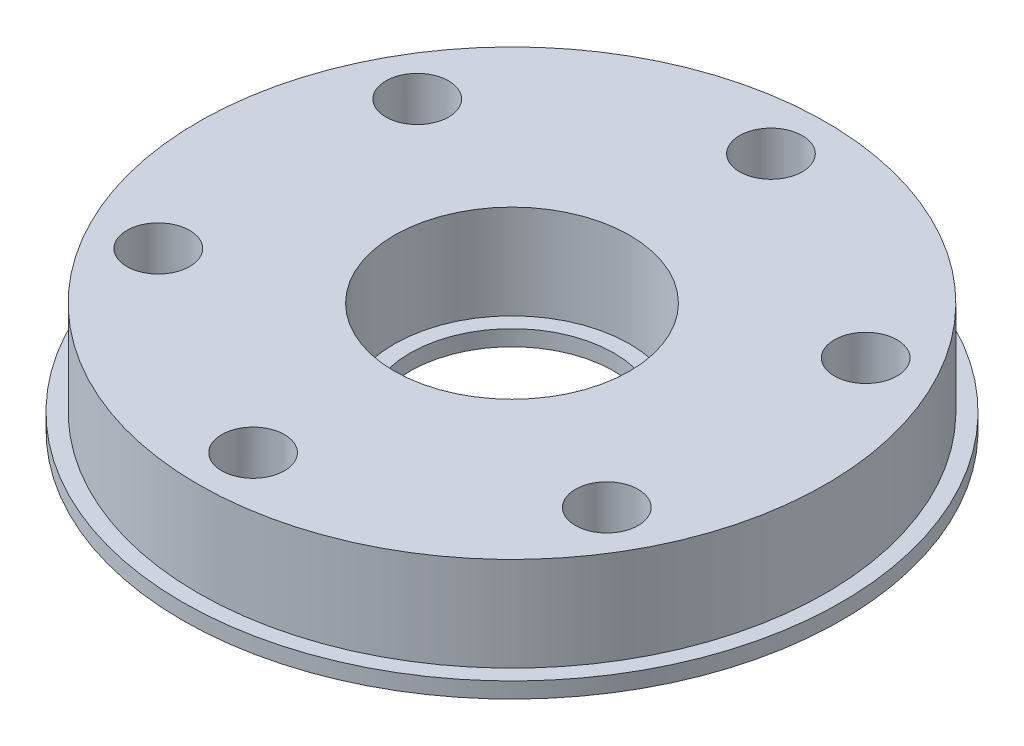
ISO-10303-21;
HEADER;
FILE_DESCRIPTION(('STEP AP214'),'2;1');
FILE_NAME('part.step','',(''),(''),'','','');
FILE_SCHEMA(('AUTOMOTIVE_DESIGN { 1 0 10303 214 1 1 1 1 }'));
ENDSEC;
DATA;
#1=APPLICATION_CONTEXT('core data for automotive mechanical design processes');
#2=APPLICATION_PROTOCOL_DEFINITION('international standard','automotive_design',2000,#1);
#3=PRODUCT_CONTEXT('',#1,'mechanical');
#4=PRODUCT('Part','Part','',(#3));
#5=PRODUCT_RELATED_PRODUCT_CATEGORY('part','',(#4));
#6=PRODUCT_DEFINITION_FORMATION('','',#4);
#7=PRODUCT_DEFINITION_CONTEXT('part definition',#1,'design');
#8=PRODUCT_DEFINITION('design','',#6,#7);
#9=PRODUCT_DEFINITION_SHAPE('','',#8);
#10=(LENGTH_UNIT() NAMED_UNIT(*) SI_UNIT(.MILLI.,.METRE.));
#11=(NAMED_UNIT(*) PLANE_ANGLE_UNIT() SI_UNIT($,.RADIAN.));
#12=(NAMED_UNIT(*) SI_UNIT($,.STERADIAN.) SOLID_ANGLE_UNIT());
#13=UNCERTAINTY_MEASURE_WITH_UNIT(LENGTH_MEASURE(1.E-05),#10,'distance_accuracy_value','');
#14=(GEOMETRIC_REPRESENTATION_CONTEXT(3) GLOBAL_UNCERTAINTY_ASSIGNED_CONTEXT((#13)) GLOBAL_UNIT_ASSIGNED_CONTEXT((#10,
#11,#12)) REPRESENTATION_CONTEXT('',''));
#15=CARTESIAN_POINT('',(0.,0.,0.));
#16=DIRECTION('',(0.,0.,1.));
#17=DIRECTION('',(1.,0.,0.));
#18=AXIS2_PLACEMENT_3D('',#15,#16,#17);
#19=CARTESIAN_POINT('',(0.,6.,0.));
#20=DIRECTION('',(0.,1.,0.));
#21=DIRECTION('',(0.,0.,1.));
#22=AXIS2_PLACEMENT_3D('',#19,#20,#21);
#23=PLANE('',#22);
#24=CARTESIAN_POINT('',(14.2894191624431,6.,-8.25000000000017));
#25=DIRECTION('',(0.,1.,0.));
#26=DIRECTION('',(-0.866025403784433,0.,0.50000000000001));
#27=AXIS2_PLACEMENT_3D('',#24,#25,#26);
#28=CIRCLE('',#27,2.);
#29=CARTESIAN_POINT('',(12.5573683548743,6.,-7.25000000000015));
#30=VERTEX_POINT('',#29);
#31=EDGE_CURVE('E63',#30,#30,#28,.T.);
#32=ORIENTED_EDGE('',*,*,#31,.F.);
#33=EDGE_LOOP('',(#32));
#34=FACE_BOUND('',#33,.T.);
#35=CARTESIAN_POINT('',(14.2894191624433,6.,8.24999999999987));
#36=DIRECTION('',(0.,1.,0.));
#37=DIRECTION('',(-0.866025403784443,0.,-0.499999999999992));
#38=AXIS2_PLACEMENT_3D('',#35,#36,#37);
#39=CIRCLE('',#38,2.);
#40=CARTESIAN_POINT('',(12.5573683548744,6.,7.24999999999988));
#41=VERTEX_POINT('',#40);
#42=EDGE_CURVE('E66',#41,#41,#39,.T.);
#43=ORIENTED_EDGE('',*,*,#42,.F.);
#44=EDGE_LOOP('',(#43));
#45=FACE_BOUND('',#44,.T.);
#46=CARTESIAN_POINT('',(0.,6.,16.5));
#47=DIRECTION('',(0.,1.,0.));
#48=DIRECTION('',(0.,0.,-1.));
#49=AXIS2_PLACEMENT_3D('',#46,#47,#48);
#50=CIRCLE('',#49,2.);
#51=CARTESIAN_POINT('',(0.,6.,14.5));
#52=VERTEX_POINT('',#51);
#53=EDGE_CURVE('E69',#52,#52,#50,.T.);
#54=ORIENTED_EDGE('',*,*,#53,.F.);
#55=EDGE_LOOP('',(#54));
#56=FACE_BOUND('',#55,.T.);
#57=CARTESIAN_POINT('',(-14.2894191624432,6.,8.25000000000007));
#58=DIRECTION('',(0.,1.,0.));
#59=DIRECTION('',(0.866025403784436,0.,-0.500000000000004));
#60=AXIS2_PLACEMENT_3D('',#57,#58,#59);
#61=CIRCLE('',#60,2.);
#62=CARTESIAN_POINT('',(-12.5573683548743,6.,7.25000000000006));
#63=VERTEX_POINT('',#62);
#64=EDGE_CURVE('E62',#63,#63,#61,.T.);
#65=ORIENTED_EDGE('',*,*,#64,.F.);
#66=EDGE_LOOP('',(#65));
#67=FACE_BOUND('',#66,.T.);
#68=CARTESIAN_POINT('',(-14.2894191624433,6.,-8.24999999999997));
#69=DIRECTION('',(0.,1.,0.));
#70=DIRECTION('',(0.86602540378444,0.,0.499999999999998));
#71=AXIS2_PLACEMENT_3D('',#68,#69,#70);
#72=CIRCLE('',#71,2.);
#73=CARTESIAN_POINT('',(-12.5573683548744,6.,-7.24999999999997));
#74=VERTEX_POINT('',#73);
#75=EDGE_CURVE('E59',#74,#74,#72,.T.);
#76=ORIENTED_EDGE('',*,*,#75,.F.);
#77=EDGE_LOOP('',(#76));
#78=FACE_BOUND('',#77,.T.);
#79=CARTESIAN_POINT('',(0.,6.,-16.5));
#80=DIRECTION('',(0.,1.,0.));
#81=DIRECTION('',(0.,0.,1.));
#82=AXIS2_PLACEMENT_3D('',#79,#80,#81);
#83=CIRCLE('',#82,2.);
#84=CARTESIAN_POINT('',(0.,6.,-14.5));
#85=VERTEX_POINT('',#84);
#86=EDGE_CURVE('E55',#85,#85,#83,.T.);
#87=ORIENTED_EDGE('',*,*,#86,.F.);
#88=EDGE_LOOP('',(#87));
#89=FACE_BOUND('',#88,.T.);
#90=CARTESIAN_POINT('',(0.,6.,0.));
#91=DIRECTION('',(0.,1.,0.));
#92=DIRECTION('',(0.,0.,1.));
#93=AXIS2_PLACEMENT_3D('',#90,#91,#92);
#94=CIRCLE('',#93,20.);
#95=CARTESIAN_POINT('',(0.,6.,20.));
#96=VERTEX_POINT('',#95);
#97=EDGE_CURVE('E10',#96,#96,#94,.T.);
#98=ORIENTED_EDGE('',*,*,#97,.T.);
#99=EDGE_LOOP('',(#98));
#100=FACE_BOUND('',#99,.T.);
#101=CARTESIAN_POINT('',(0.,6.,0.));
#102=DIRECTION('',(0.,1.,0.));
#103=DIRECTION('',(0.,0.,1.));
#104=AXIS2_PLACEMENT_3D('',#101,#102,#103);
#105=CIRCLE('',#104,7.5);
#106=CARTESIAN_POINT('',(0.,6.,7.5));
#107=VERTEX_POINT('',#106);
#108=EDGE_CURVE('E47',#107,#107,#105,.T.);
#109=ORIENTED_EDGE('',*,*,#108,.F.);
#110=EDGE_LOOP('',(#109));
#111=FACE_BOUND('',#110,.T.);
#112=ADVANCED_FACE('F39',(#34,#45,#56,#67,#78,#89,#100,#111),#23,.T.);
#113=CARTESIAN_POINT('',(0.,6.,0.));
#114=DIRECTION('',(0.,-1.,0.));
#115=DIRECTION('',(0.,0.,-1.));
#116=AXIS2_PLACEMENT_3D('',#113,#114,#115);
#117=CYLINDRICAL_SURFACE('',#116,20.);
#118=ORIENTED_EDGE('',*,*,#97,.F.);
#119=EDGE_LOOP('',(#118));
#120=FACE_BOUND('',#119,.T.);
#121=CARTESIAN_POINT('',(0.,0.,0.));
#122=DIRECTION('',(0.,1.,0.));
#123=DIRECTION('',(0.,0.,1.));
#124=AXIS2_PLACEMENT_3D('',#121,#122,#123);
#125=CIRCLE('',#124,20.);
#126=CARTESIAN_POINT('',(0.,0.,20.));
#127=VERTEX_POINT('',#126);
#128=EDGE_CURVE('E43',#127,#127,#125,.T.);
#129=ORIENTED_EDGE('',*,*,#128,.T.);
#130=EDGE_LOOP('',(#129));
#131=FACE_BOUND('',#130,.T.);
#132=ADVANCED_FACE('F41',(#120,#131),#117,.T.);
#133=CARTESIAN_POINT('',(0.,6.,0.));
#134=DIRECTION('',(0.,-1.,0.));
#135=DIRECTION('',(0.,0.,-1.));
#136=AXIS2_PLACEMENT_3D('',#133,#134,#135);
#137=CYLINDRICAL_SURFACE('',#136,7.5);
#138=ORIENTED_EDGE('',*,*,#108,.T.);
#139=EDGE_LOOP('',(#138));
#140=FACE_BOUND('',#139,.T.);
#141=CARTESIAN_POINT('',(0.,0.,0.));
#142=DIRECTION('',(0.,1.,0.));
#143=DIRECTION('',(0.,0.,1.));
#144=AXIS2_PLACEMENT_3D('',#141,#142,#143);
#145=CIRCLE('',#144,7.5);
#146=CARTESIAN_POINT('',(0.,0.,7.5));
#147=VERTEX_POINT('',#146);
#148=EDGE_CURVE('E51',#147,#147,#145,.T.);
#149=ORIENTED_EDGE('',*,*,#148,.F.);
#150=EDGE_LOOP('',(#149));
#151=FACE_BOUND('',#150,.T.);
#152=ADVANCED_FACE('F121',(#140,#151),#137,.F.);
#153=CARTESIAN_POINT('',(0.,0.,-16.5));
#154=DIRECTION('',(0.,1.,0.));
#155=DIRECTION('',(0.,0.,1.));
#156=AXIS2_PLACEMENT_3D('',#153,#154,#155);
#157=CYLINDRICAL_SURFACE('',#156,2.);
#158=ORIENTED_EDGE('',*,*,#86,.T.);
#159=EDGE_LOOP('',(#158));
#160=FACE_BOUND('',#159,.T.);
#161=CARTESIAN_POINT('',(0.,-1.,-16.5));
#162=DIRECTION('',(0.,1.,0.));
#163=DIRECTION('',(0.,0.,1.));
#164=AXIS2_PLACEMENT_3D('',#161,#162,#163);
#165=CIRCLE('',#164,2.);
#166=CARTESIAN_POINT('',(0.,-1.,-14.5));
#167=VERTEX_POINT('',#166);
#168=EDGE_CURVE('E98',#167,#167,#165,.T.);
#169=ORIENTED_EDGE('',*,*,#168,.F.);
#170=EDGE_LOOP('',(#169));
#171=FACE_BOUND('',#170,.T.);
#172=ADVANCED_FACE('F111',(#160,#171),#157,.F.);
#173=CARTESIAN_POINT('',(-14.2894191624433,0.,-8.24999999999997));
#174=DIRECTION('',(0.,1.,0.));
#175=DIRECTION('',(0.,0.,1.));
#176=AXIS2_PLACEMENT_3D('',#173,#174,#175);
#177=CYLINDRICAL_SURFACE('',#176,2.);
#178=ORIENTED_EDGE('',*,*,#75,.T.);
#179=EDGE_LOOP('',(#178));
#180=FACE_BOUND('',#179,.T.);
#181=CARTESIAN_POINT('',(-14.2894191624433,-1.,-8.24999999999997));
#182=DIRECTION('',(0.,1.,0.));
#183=DIRECTION('',(0.,0.,1.));
#184=AXIS2_PLACEMENT_3D('',#181,#182,#183);
#185=CIRCLE('',#184,2.);
#186=CARTESIAN_POINT('',(-14.2894191624433,-1.,-6.24999999999997));
#187=VERTEX_POINT('',#186);
#188=EDGE_CURVE('E101',#187,#187,#185,.T.);
#189=ORIENTED_EDGE('',*,*,#188,.F.);
#190=EDGE_LOOP('',(#189));
#191=FACE_BOUND('',#190,.T.);
#192=ADVANCED_FACE('F108',(#180,#191),#177,.F.);
#193=CARTESIAN_POINT('',(-14.2894191624432,0.,8.25000000000007));
#194=DIRECTION('',(0.,1.,0.));
#195=DIRECTION('',(0.,0.,1.));
#196=AXIS2_PLACEMENT_3D('',#193,#194,#195);
#197=CYLINDRICAL_SURFACE('',#196,2.);
#198=ORIENTED_EDGE('',*,*,#64,.T.);
#199=EDGE_LOOP('',(#198));
#200=FACE_BOUND('',#199,.T.);
#201=CARTESIAN_POINT('',(-14.2894191624432,-1.,8.25000000000007));
#202=DIRECTION('',(0.,1.,0.));
#203=DIRECTION('',(0.,0.,1.));
#204=AXIS2_PLACEMENT_3D('',#201,#202,#203);
#205=CIRCLE('',#204,2.);
#206=CARTESIAN_POINT('',(-14.2894191624432,-1.,10.2500000000001));
#207=VERTEX_POINT('',#206);
#208=EDGE_CURVE('E78',#207,#207,#205,.T.);
#209=ORIENTED_EDGE('',*,*,#208,.F.);
#210=EDGE_LOOP('',(#209));
#211=FACE_BOUND('',#210,.T.);
#212=ADVANCED_FACE('F110',(#200,#211),#197,.F.);
#213=CARTESIAN_POINT('',(0.,0.,16.5));
#214=DIRECTION('',(0.,1.,0.));
#215=DIRECTION('',(0.,0.,1.));
#216=AXIS2_PLACEMENT_3D('',#213,#214,#215);
#217=CYLINDRICAL_SURFACE('',#216,2.);
#218=ORIENTED_EDGE('',*,*,#53,.T.);
#219=EDGE_LOOP('',(#218));
#220=FACE_BOUND('',#219,.T.);
#221=CARTESIAN_POINT('',(0.,-1.,16.5));
#222=DIRECTION('',(0.,1.,0.));
#223=DIRECTION('',(0.,0.,1.));
#224=AXIS2_PLACEMENT_3D('',#221,#222,#223);
#225=CIRCLE('',#224,2.);
#226=CARTESIAN_POINT('',(0.,-1.,18.5));
#227=VERTEX_POINT('',#226);
#228=EDGE_CURVE('E87',#227,#227,#225,.T.);
#229=ORIENTED_EDGE('',*,*,#228,.F.);
#230=EDGE_LOOP('',(#229));
#231=FACE_BOUND('',#230,.T.);
#232=ADVANCED_FACE('F118',(#220,#231),#217,.F.);
#233=CARTESIAN_POINT('',(14.2894191624433,0.,8.24999999999987));
#234=DIRECTION('',(0.,1.,0.));
#235=DIRECTION('',(0.,0.,1.));
#236=AXIS2_PLACEMENT_3D('',#233,#234,#235);
#237=CYLINDRICAL_SURFACE('',#236,2.);
#238=ORIENTED_EDGE('',*,*,#42,.T.);
#239=EDGE_LOOP('',(#238));
#240=FACE_BOUND('',#239,.T.);
#241=CARTESIAN_POINT('',(14.2894191624433,-1.,8.24999999999987));
#242=DIRECTION('',(0.,1.,0.));
#243=DIRECTION('',(0.,0.,1.));
#244=AXIS2_PLACEMENT_3D('',#241,#242,#243);
#245=CIRCLE('',#244,2.);
#246=CARTESIAN_POINT('',(14.2894191624433,-1.,10.2499999999999));
#247=VERTEX_POINT('',#246);
#248=EDGE_CURVE('E92',#247,#247,#245,.T.);
#249=ORIENTED_EDGE('',*,*,#248,.F.);
#250=EDGE_LOOP('',(#249));
#251=FACE_BOUND('',#250,.T.);
#252=ADVANCED_FACE('F155',(#240,#251),#237,.F.);
#253=CARTESIAN_POINT('',(14.2894191624431,0.,-8.25000000000017));
#254=DIRECTION('',(0.,1.,0.));
#255=DIRECTION('',(0.,0.,1.));
#256=AXIS2_PLACEMENT_3D('',#253,#254,#255);
#257=CYLINDRICAL_SURFACE('',#256,2.);
#258=ORIENTED_EDGE('',*,*,#31,.T.);
#259=EDGE_LOOP('',(#258));
#260=FACE_BOUND('',#259,.T.);
#261=CARTESIAN_POINT('',(14.2894191624431,-1.,-8.25000000000017));
#262=DIRECTION('',(0.,1.,0.));
#263=DIRECTION('',(0.,0.,1.));
#264=AXIS2_PLACEMENT_3D('',#261,#262,#263);
#265=CIRCLE('',#264,2.);
#266=CARTESIAN_POINT('',(14.2894191624431,-1.,-6.25000000000017));
#267=VERTEX_POINT('',#266);
#268=EDGE_CURVE('E95',#267,#267,#265,.T.);
#269=ORIENTED_EDGE('',*,*,#268,.F.);
#270=EDGE_LOOP('',(#269));
#271=FACE_BOUND('',#270,.T.);
#272=ADVANCED_FACE('F145',(#260,#271),#257,.F.);
#273=CARTESIAN_POINT('',(0.,0.,0.));
#274=DIRECTION('',(0.,1.,0.));
#275=DIRECTION('',(0.,0.,1.));
#276=AXIS2_PLACEMENT_3D('',#273,#274,#275);
#277=PLANE('',#276);
#278=CARTESIAN_POINT('',(0.,0.,0.));
#279=DIRECTION('',(0.,1.,0.));
#280=DIRECTION('',(0.,0.,1.));
#281=AXIS2_PLACEMENT_3D('',#278,#279,#280);
#282=CIRCLE('',#281,6.5);
#283=CARTESIAN_POINT('',(0.,0.,6.5));
#284=VERTEX_POINT('',#283);
#285=EDGE_CURVE('E84',#284,#284,#282,.T.);
#286=ORIENTED_EDGE('',*,*,#285,.F.);
#287=EDGE_LOOP('',(#286));
#288=FACE_BOUND('',#287,.T.);
#289=ORIENTED_EDGE('',*,*,#148,.T.);
#290=EDGE_LOOP('',(#289));
#291=FACE_BOUND('',#290,.T.);
#292=ADVANCED_FACE('F142',(#288,#291),#277,.T.);
#293=CARTESIAN_POINT('',(0.,-1.,0.));
#294=DIRECTION('',(0.,1.,0.));
#295=DIRECTION('',(0.,0.,1.));
#296=AXIS2_PLACEMENT_3D('',#293,#294,#295);
#297=CYLINDRICAL_SURFACE('',#296,21.);
#298=CARTESIAN_POINT('',(0.,-1.,0.));
#299=DIRECTION('',(0.,1.,0.));
#300=DIRECTION('',(0.,0.,1.));
#301=AXIS2_PLACEMENT_3D('',#298,#299,#300);
#302=CIRCLE('',#301,21.);
#303=CARTESIAN_POINT('',(0.,-1.,21.));
#304=VERTEX_POINT('',#303);
#305=EDGE_CURVE('E77',#304,#304,#302,.T.);
#306=ORIENTED_EDGE('',*,*,#305,.T.);
#307=EDGE_LOOP('',(#306));
#308=FACE_BOUND('',#307,.T.);
#309=CARTESIAN_POINT('',(0.,0.,0.));
#310=DIRECTION('',(0.,1.,0.));
#311=DIRECTION('',(0.,0.,1.));
#312=AXIS2_PLACEMENT_3D('',#309,#310,#311);
#313=CIRCLE('',#312,21.);
#314=CARTESIAN_POINT('',(0.,0.,21.));
#315=VERTEX_POINT('',#314);
#316=EDGE_CURVE('E74',#315,#315,#313,.T.);
#317=ORIENTED_EDGE('',*,*,#316,.F.);
#318=EDGE_LOOP('',(#317));
#319=FACE_BOUND('',#318,.T.);
#320=ADVANCED_FACE('F144',(#308,#319),#297,.T.);
#321=CARTESIAN_POINT('',(0.,-1.,0.));
#322=DIRECTION('',(0.,1.,0.));
#323=DIRECTION('',(0.,0.,1.));
#324=AXIS2_PLACEMENT_3D('',#321,#322,#323);
#325=PLANE('',#324);
#326=ORIENTED_EDGE('',*,*,#188,.T.);
#327=EDGE_LOOP('',(#326));
#328=FACE_BOUND('',#327,.T.);
#329=ORIENTED_EDGE('',*,*,#168,.T.);
#330=EDGE_LOOP('',(#329));
#331=FACE_BOUND('',#330,.T.);
#332=ORIENTED_EDGE('',*,*,#268,.T.);
#333=EDGE_LOOP('',(#332));
#334=FACE_BOUND('',#333,.T.);
#335=ORIENTED_EDGE('',*,*,#248,.T.);
#336=EDGE_LOOP('',(#335));
#337=FACE_BOUND('',#336,.T.);
#338=ORIENTED_EDGE('',*,*,#228,.T.);
#339=EDGE_LOOP('',(#338));
#340=FACE_BOUND('',#339,.T.);
#341=CARTESIAN_POINT('',(0.,-1.,0.));
#342=DIRECTION('',(0.,1.,0.));
#343=DIRECTION('',(0.,0.,1.));
#344=AXIS2_PLACEMENT_3D('',#341,#342,#343);
#345=CIRCLE('',#344,6.5);
#346=CARTESIAN_POINT('',(0.,-1.,6.5));
#347=VERTEX_POINT('',#346);
#348=EDGE_CURVE('E83',#347,#347,#345,.T.);
#349=ORIENTED_EDGE('',*,*,#348,.T.);
#350=EDGE_LOOP('',(#349));
#351=FACE_BOUND('',#350,.T.);
#352=ORIENTED_EDGE('',*,*,#208,.T.);
#353=EDGE_LOOP('',(#352));
#354=FACE_BOUND('',#353,.T.);
#355=ORIENTED_EDGE('',*,*,#305,.F.);
#356=EDGE_LOOP('',(#355));
#357=FACE_BOUND('',#356,.T.);
#358=ADVANCED_FACE('F105',(#328,#331,#334,#337,#340,#351,#354,#357),#325,.F.);
#359=ORIENTED_EDGE('',*,*,#128,.F.);
#360=EDGE_LOOP('',(#359));
#361=FACE_BOUND('',#360,.T.);
#362=ORIENTED_EDGE('',*,*,#316,.T.);
#363=EDGE_LOOP('',(#362));
#364=FACE_BOUND('',#363,.T.);
#365=ADVANCED_FACE('F148',(#361,#364),#277,.T.);
#366=CARTESIAN_POINT('',(0.,-1.,0.));
#367=DIRECTION('',(0.,1.,0.));
#368=DIRECTION('',(0.,0.,1.));
#369=AXIS2_PLACEMENT_3D('',#366,#367,#368);
#370=CYLINDRICAL_SURFACE('',#369,6.5);
#371=ORIENTED_EDGE('',*,*,#348,.F.);
#372=EDGE_LOOP('',(#371));
#373=FACE_BOUND('',#372,.T.);
#374=ORIENTED_EDGE('',*,*,#285,.T.);
#375=EDGE_LOOP('',(#374));
#376=FACE_BOUND('',#375,.T.);
#377=ADVANCED_FACE('F160',(#373,#376),#370,.F.);
#378=CLOSED_SHELL('',(#112,#132,#152,#172,#192,#212,#232,#252,#272,#292,#320,#358,#365,#377));
#379=MANIFOLD_SOLID_BREP('B2',#378);
#380=ADVANCED_BREP_SHAPE_REPRESENTATION('',(#18,#379),#14);
#381=SHAPE_DEFINITION_REPRESENTATION(#9,#380);
ENDSEC;
END-ISO-10303-21;
